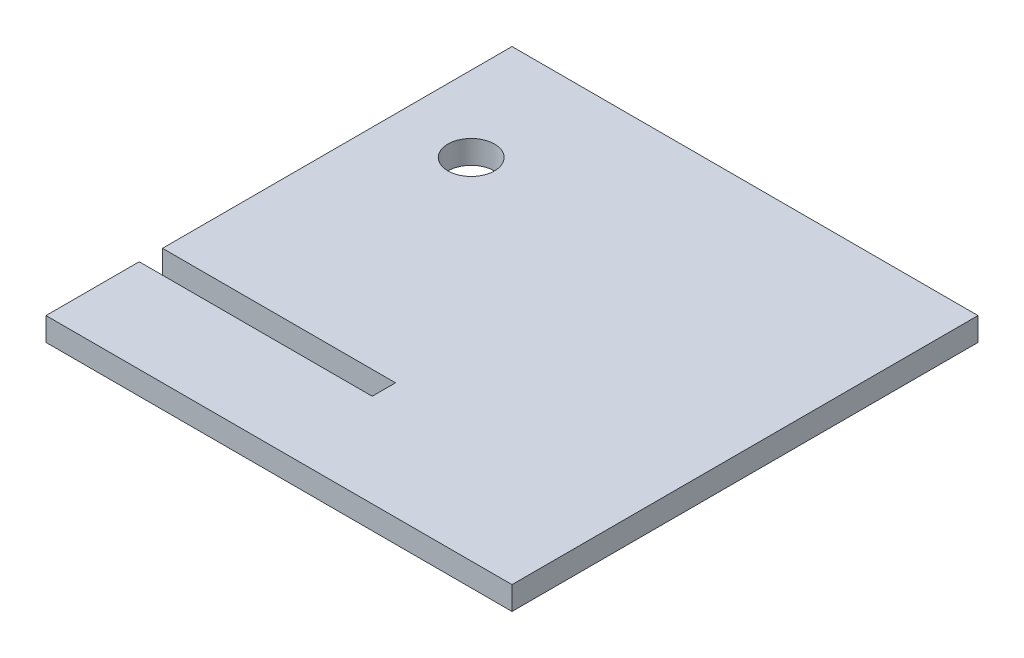
ISO-10303-21;
HEADER;
FILE_DESCRIPTION(('STEP AP214'),'2;1');
FILE_NAME('part.step','',(''),(''),'','','');
FILE_SCHEMA(('AUTOMOTIVE_DESIGN { 1 0 10303 214 1 1 1 1 }'));
ENDSEC;
DATA;
#1=APPLICATION_CONTEXT('core data for automotive mechanical design processes');
#2=APPLICATION_PROTOCOL_DEFINITION('international standard','automotive_design',2000,#1);
#3=PRODUCT_CONTEXT('',#1,'mechanical');
#4=PRODUCT('Part','Part','',(#3));
#5=PRODUCT_RELATED_PRODUCT_CATEGORY('part','',(#4));
#6=PRODUCT_DEFINITION_FORMATION('','',#4);
#7=PRODUCT_DEFINITION_CONTEXT('part definition',#1,'design');
#8=PRODUCT_DEFINITION('design','',#6,#7);
#9=PRODUCT_DEFINITION_SHAPE('','',#8);
#10=(LENGTH_UNIT() NAMED_UNIT(*) SI_UNIT(.MILLI.,.METRE.));
#11=(NAMED_UNIT(*) PLANE_ANGLE_UNIT() SI_UNIT($,.RADIAN.));
#12=(NAMED_UNIT(*) SI_UNIT($,.STERADIAN.) SOLID_ANGLE_UNIT());
#13=UNCERTAINTY_MEASURE_WITH_UNIT(LENGTH_MEASURE(1.E-05),#10,'distance_accuracy_value','');
#14=(GEOMETRIC_REPRESENTATION_CONTEXT(3) GLOBAL_UNCERTAINTY_ASSIGNED_CONTEXT((#13)) GLOBAL_UNIT_ASSIGNED_CONTEXT((#10,
#11,#12)) REPRESENTATION_CONTEXT('',''));
#15=CARTESIAN_POINT('',(0.,0.,0.));
#16=DIRECTION('',(0.,0.,1.));
#17=DIRECTION('',(1.,0.,0.));
#18=AXIS2_PLACEMENT_3D('',#15,#16,#17);
#19=CARTESIAN_POINT('',(-127.,6.35,0.));
#20=DIRECTION('',(1.,0.,0.));
#21=DIRECTION('',(0.,0.,-1.));
#22=AXIS2_PLACEMENT_3D('',#19,#20,#21);
#23=PLANE('',#22);
#24=DIRECTION('',(0.,0.,1.));
#25=VECTOR('',#24,1.);
#26=CARTESIAN_POINT('',(-127.,-6.35,0.));
#27=LINE('',#26,#25);
#28=CARTESIAN_POINT('',(-127.,-6.35,-254.));
#29=VERTEX_POINT('',#28);
#30=CARTESIAN_POINT('',(-127.,-6.35,-63.4999999999984));
#31=VERTEX_POINT('',#30);
#32=EDGE_CURVE('E124',#29,#31,#27,.T.);
#33=ORIENTED_EDGE('',*,*,#32,.T.);
#34=DIRECTION('',(0.,1.,0.));
#35=VECTOR('',#34,1.);
#36=CARTESIAN_POINT('',(-127.,-6.35,-63.4999999999984));
#37=LINE('',#36,#35);
#38=CARTESIAN_POINT('',(-127.,6.35,-63.4999999999984));
#39=VERTEX_POINT('',#38);
#40=EDGE_CURVE('E98',#31,#39,#37,.T.);
#41=ORIENTED_EDGE('',*,*,#40,.T.);
#42=DIRECTION('',(0.,0.,1.));
#43=VECTOR('',#42,1.);
#44=CARTESIAN_POINT('',(-127.,6.35,0.));
#45=LINE('',#44,#43);
#46=CARTESIAN_POINT('',(-127.,6.35,-254.));
#47=VERTEX_POINT('',#46);
#48=EDGE_CURVE('E126',#47,#39,#45,.T.);
#49=ORIENTED_EDGE('',*,*,#48,.F.);
#50=DIRECTION('',(0.,-1.,0.));
#51=VECTOR('',#50,1.);
#52=CARTESIAN_POINT('',(-127.,6.35,-254.));
#53=LINE('',#52,#51);
#54=EDGE_CURVE('E113',#47,#29,#53,.T.);
#55=ORIENTED_EDGE('',*,*,#54,.T.);
#56=EDGE_LOOP('',(#33,#41,#49,#55));
#57=FACE_BOUND('',#56,.T.);
#58=ADVANCED_FACE('F37',(#57),#23,.F.);
#59=CARTESIAN_POINT('',(-127.,6.35,-50.7999999999983));
#60=VERTEX_POINT('',#59);
#61=CARTESIAN_POINT('',(-127.,6.35,0.));
#62=VERTEX_POINT('',#61);
#63=EDGE_CURVE('E81',#60,#62,#45,.T.);
#64=ORIENTED_EDGE('',*,*,#63,.F.);
#65=DIRECTION('',(0.,1.,0.));
#66=VECTOR('',#65,1.);
#67=CARTESIAN_POINT('',(-127.,-6.35,-50.7999999999983));
#68=LINE('',#67,#66);
#69=CARTESIAN_POINT('',(-127.,-6.35,-50.7999999999983));
#70=VERTEX_POINT('',#69);
#71=EDGE_CURVE('E151',#70,#60,#68,.T.);
#72=ORIENTED_EDGE('',*,*,#71,.F.);
#73=CARTESIAN_POINT('',(-127.,-6.35,0.));
#74=VERTEX_POINT('',#73);
#75=EDGE_CURVE('E61',#70,#74,#27,.T.);
#76=ORIENTED_EDGE('',*,*,#75,.T.);
#77=DIRECTION('',(0.,-1.,0.));
#78=VECTOR('',#77,1.);
#79=CARTESIAN_POINT('',(-127.,6.35,0.));
#80=LINE('',#79,#78);
#81=EDGE_CURVE('E146',#62,#74,#80,.T.);
#82=ORIENTED_EDGE('',*,*,#81,.F.);
#83=EDGE_LOOP('',(#64,#72,#76,#82));
#84=FACE_BOUND('',#83,.T.);
#85=ADVANCED_FACE('F184',(#84),#23,.F.);
#86=CARTESIAN_POINT('',(-127.,6.35,0.));
#87=DIRECTION('',(0.,0.,-1.));
#88=DIRECTION('',(-1.,0.,0.));
#89=AXIS2_PLACEMENT_3D('',#86,#87,#88);
#90=PLANE('',#89);
#91=DIRECTION('',(1.,0.,0.));
#92=VECTOR('',#91,1.);
#93=CARTESIAN_POINT('',(-127.,-6.35,0.));
#94=LINE('',#93,#92);
#95=CARTESIAN_POINT('',(127.,-6.35,0.));
#96=VERTEX_POINT('',#95);
#97=EDGE_CURVE('E89',#74,#96,#94,.T.);
#98=ORIENTED_EDGE('',*,*,#97,.T.);
#99=DIRECTION('',(0.,-1.,0.));
#100=VECTOR('',#99,1.);
#101=CARTESIAN_POINT('',(127.,6.35,0.));
#102=LINE('',#101,#100);
#103=CARTESIAN_POINT('',(127.,6.35,0.));
#104=VERTEX_POINT('',#103);
#105=EDGE_CURVE('E120',#104,#96,#102,.T.);
#106=ORIENTED_EDGE('',*,*,#105,.F.);
#107=DIRECTION('',(1.,0.,0.));
#108=VECTOR('',#107,1.);
#109=CARTESIAN_POINT('',(-127.,6.35,0.));
#110=LINE('',#109,#108);
#111=EDGE_CURVE('E139',#62,#104,#110,.T.);
#112=ORIENTED_EDGE('',*,*,#111,.F.);
#113=ORIENTED_EDGE('',*,*,#81,.T.);
#114=EDGE_LOOP('',(#98,#106,#112,#113));
#115=FACE_BOUND('',#114,.T.);
#116=ADVANCED_FACE('F186',(#115),#90,.F.);
#117=CARTESIAN_POINT('',(127.,6.35,0.));
#118=DIRECTION('',(-1.,0.,0.));
#119=DIRECTION('',(0.,0.,1.));
#120=AXIS2_PLACEMENT_3D('',#117,#118,#119);
#121=PLANE('',#120);
#122=DIRECTION('',(0.,0.,-1.));
#123=VECTOR('',#122,1.);
#124=CARTESIAN_POINT('',(127.,-6.35,0.));
#125=LINE('',#124,#123);
#126=CARTESIAN_POINT('',(127.,-6.35,-254.));
#127=VERTEX_POINT('',#126);
#128=EDGE_CURVE('E145',#96,#127,#125,.T.);
#129=ORIENTED_EDGE('',*,*,#128,.T.);
#130=DIRECTION('',(0.,-1.,0.));
#131=VECTOR('',#130,1.);
#132=CARTESIAN_POINT('',(127.,6.35,-254.));
#133=LINE('',#132,#131);
#134=CARTESIAN_POINT('',(127.,6.35,-254.));
#135=VERTEX_POINT('',#134);
#136=EDGE_CURVE('E116',#135,#127,#133,.T.);
#137=ORIENTED_EDGE('',*,*,#136,.F.);
#138=DIRECTION('',(0.,0.,-1.));
#139=VECTOR('',#138,1.);
#140=CARTESIAN_POINT('',(127.,6.35,0.));
#141=LINE('',#140,#139);
#142=EDGE_CURVE('E137',#104,#135,#141,.T.);
#143=ORIENTED_EDGE('',*,*,#142,.F.);
#144=ORIENTED_EDGE('',*,*,#105,.T.);
#145=EDGE_LOOP('',(#129,#137,#143,#144));
#146=FACE_BOUND('',#145,.T.);
#147=ADVANCED_FACE('F192',(#146),#121,.F.);
#148=CARTESIAN_POINT('',(-127.,6.35,-254.));
#149=DIRECTION('',(0.,0.,1.));
#150=DIRECTION('',(1.,0.,0.));
#151=AXIS2_PLACEMENT_3D('',#148,#149,#150);
#152=PLANE('',#151);
#153=DIRECTION('',(-1.,0.,0.));
#154=VECTOR('',#153,1.);
#155=CARTESIAN_POINT('',(-127.,-6.35,-254.));
#156=LINE('',#155,#154);
#157=EDGE_CURVE('E109',#127,#29,#156,.T.);
#158=ORIENTED_EDGE('',*,*,#157,.T.);
#159=ORIENTED_EDGE('',*,*,#54,.F.);
#160=DIRECTION('',(-1.,0.,0.));
#161=VECTOR('',#160,1.);
#162=CARTESIAN_POINT('',(-127.,6.35,-254.));
#163=LINE('',#162,#161);
#164=EDGE_CURVE('E135',#135,#47,#163,.T.);
#165=ORIENTED_EDGE('',*,*,#164,.F.);
#166=ORIENTED_EDGE('',*,*,#136,.T.);
#167=EDGE_LOOP('',(#158,#159,#165,#166));
#168=FACE_BOUND('',#167,.T.);
#169=ADVANCED_FACE('F111',(#168),#152,.F.);
#170=CARTESIAN_POINT('',(0.,6.35,0.));
#171=DIRECTION('',(0.,-1.,0.));
#172=DIRECTION('',(0.,0.,-1.));
#173=AXIS2_PLACEMENT_3D('',#170,#171,#172);
#174=PLANE('',#173);
#175=CARTESIAN_POINT('',(-85.7499999999946,6.34999999999999,-190.5));
#176=DIRECTION('',(0.,-1.,0.));
#177=DIRECTION('',(0.,0.,-1.));
#178=AXIS2_PLACEMENT_3D('',#175,#176,#177);
#179=CIRCLE('',#178,12.7);
#180=CARTESIAN_POINT('',(-85.7499999999946,6.34999999999999,-203.2));
#181=VERTEX_POINT('',#180);
#182=EDGE_CURVE('E11',#181,#181,#179,.F.);
#183=ORIENTED_EDGE('',*,*,#182,.F.);
#184=EDGE_LOOP('',(#183));
#185=FACE_BOUND('',#184,.T.);
#186=ORIENTED_EDGE('',*,*,#48,.T.);
#187=DIRECTION('',(-1.,0.,0.));
#188=VECTOR('',#187,1.);
#189=CARTESIAN_POINT('',(-127.,6.35,-63.4999999999984));
#190=LINE('',#189,#188);
#191=CARTESIAN_POINT('',(-1.11022302462516E-13,6.35,-63.4999999999984));
#192=VERTEX_POINT('',#191);
#193=EDGE_CURVE('E165',#192,#39,#190,.T.);
#194=ORIENTED_EDGE('',*,*,#193,.F.);
#195=DIRECTION('',(0.,0.,-1.));
#196=VECTOR('',#195,1.);
#197=CARTESIAN_POINT('',(-1.11022302462516E-13,6.35,-63.4999999999984));
#198=LINE('',#197,#196);
#199=CARTESIAN_POINT('',(-1.11022302462516E-13,6.35,-50.7999999999983));
#200=VERTEX_POINT('',#199);
#201=EDGE_CURVE('E167',#200,#192,#198,.T.);
#202=ORIENTED_EDGE('',*,*,#201,.F.);
#203=DIRECTION('',(1.,0.,0.));
#204=VECTOR('',#203,1.);
#205=CARTESIAN_POINT('',(-127.,6.35,-50.7999999999983));
#206=LINE('',#205,#204);
#207=EDGE_CURVE('E170',#60,#200,#206,.T.);
#208=ORIENTED_EDGE('',*,*,#207,.F.);
#209=ORIENTED_EDGE('',*,*,#63,.T.);
#210=ORIENTED_EDGE('',*,*,#111,.T.);
#211=ORIENTED_EDGE('',*,*,#142,.T.);
#212=ORIENTED_EDGE('',*,*,#164,.T.);
#213=EDGE_LOOP('',(#186,#194,#202,#208,#209,#210,#211,#212));
#214=FACE_BOUND('',#213,.T.);
#215=ADVANCED_FACE('F39',(#185,#214),#174,.F.);
#216=CARTESIAN_POINT('',(0.,-6.35,0.));
#217=DIRECTION('',(0.,-1.,0.));
#218=DIRECTION('',(0.,0.,-1.));
#219=AXIS2_PLACEMENT_3D('',#216,#217,#218);
#220=PLANE('',#219);
#221=DIRECTION('',(-1.,0.,0.));
#222=VECTOR('',#221,1.);
#223=CARTESIAN_POINT('',(-127.,-6.35,-63.4999999999984));
#224=LINE('',#223,#222);
#225=CARTESIAN_POINT('',(-1.11022302462516E-13,-6.35,-63.4999999999984));
#226=VERTEX_POINT('',#225);
#227=EDGE_CURVE('E130',#226,#31,#224,.T.);
#228=ORIENTED_EDGE('',*,*,#227,.T.);
#229=ORIENTED_EDGE('',*,*,#32,.F.);
#230=ORIENTED_EDGE('',*,*,#157,.F.);
#231=ORIENTED_EDGE('',*,*,#128,.F.);
#232=ORIENTED_EDGE('',*,*,#97,.F.);
#233=ORIENTED_EDGE('',*,*,#75,.F.);
#234=DIRECTION('',(1.,0.,0.));
#235=VECTOR('',#234,1.);
#236=CARTESIAN_POINT('',(-127.,-6.35,-50.7999999999983));
#237=LINE('',#236,#235);
#238=CARTESIAN_POINT('',(-1.11022302462516E-13,-6.35,-50.7999999999983));
#239=VERTEX_POINT('',#238);
#240=EDGE_CURVE('E162',#70,#239,#237,.T.);
#241=ORIENTED_EDGE('',*,*,#240,.T.);
#242=DIRECTION('',(0.,0.,-1.));
#243=VECTOR('',#242,1.);
#244=CARTESIAN_POINT('',(-1.11022302462516E-13,-6.35,-63.4999999999984));
#245=LINE('',#244,#243);
#246=EDGE_CURVE('E52',#239,#226,#245,.T.);
#247=ORIENTED_EDGE('',*,*,#246,.T.);
#248=EDGE_LOOP('',(#228,#229,#230,#231,#232,#233,#241,#247));
#249=FACE_BOUND('',#248,.T.);
#250=CARTESIAN_POINT('',(-85.7499999999946,-6.34999999999999,-190.5));
#251=DIRECTION('',(0.,-1.,0.));
#252=DIRECTION('',(0.,0.,-1.));
#253=AXIS2_PLACEMENT_3D('',#250,#251,#252);
#254=CIRCLE('',#253,12.7);
#255=CARTESIAN_POINT('',(-85.7499999999946,-6.34999999999999,-203.2));
#256=VERTEX_POINT('',#255);
#257=EDGE_CURVE('E45',#256,#256,#254,.F.);
#258=ORIENTED_EDGE('',*,*,#257,.T.);
#259=EDGE_LOOP('',(#258));
#260=FACE_BOUND('',#259,.T.);
#261=ADVANCED_FACE('F128',(#249,#260),#220,.T.);
#262=CARTESIAN_POINT('',(-85.7499999999946,115.050000000001,-190.5));
#263=DIRECTION('',(0.,-1.,0.));
#264=DIRECTION('',(1.,0.,0.));
#265=AXIS2_PLACEMENT_3D('',#262,#263,#264);
#266=CYLINDRICAL_SURFACE('',#265,12.7);
#267=ORIENTED_EDGE('',*,*,#257,.F.);
#268=EDGE_LOOP('',(#267));
#269=FACE_BOUND('',#268,.T.);
#270=ORIENTED_EDGE('',*,*,#182,.T.);
#271=EDGE_LOOP('',(#270));
#272=FACE_BOUND('',#271,.T.);
#273=ADVANCED_FACE('F201',(#269,#272),#266,.F.);
#274=CARTESIAN_POINT('',(-127.,-6.35,-63.4999999999984));
#275=DIRECTION('',(0.,0.,-1.));
#276=DIRECTION('',(-1.,0.,0.));
#277=AXIS2_PLACEMENT_3D('',#274,#275,#276);
#278=PLANE('',#277);
#279=ORIENTED_EDGE('',*,*,#40,.F.);
#280=ORIENTED_EDGE('',*,*,#227,.F.);
#281=DIRECTION('',(0.,1.,0.));
#282=VECTOR('',#281,1.);
#283=CARTESIAN_POINT('',(-1.11022302462516E-13,-6.35,-63.4999999999984));
#284=LINE('',#283,#282);
#285=EDGE_CURVE('E156',#226,#192,#284,.T.);
#286=ORIENTED_EDGE('',*,*,#285,.T.);
#287=ORIENTED_EDGE('',*,*,#193,.T.);
#288=EDGE_LOOP('',(#279,#280,#286,#287));
#289=FACE_BOUND('',#288,.T.);
#290=ADVANCED_FACE('F203',(#289),#278,.F.);
#291=CARTESIAN_POINT('',(-1.11022302462516E-13,-6.35,-63.4999999999984));
#292=DIRECTION('',(1.,0.,0.));
#293=DIRECTION('',(0.,0.,-1.));
#294=AXIS2_PLACEMENT_3D('',#291,#292,#293);
#295=PLANE('',#294);
#296=ORIENTED_EDGE('',*,*,#285,.F.);
#297=ORIENTED_EDGE('',*,*,#246,.F.);
#298=DIRECTION('',(0.,1.,0.));
#299=VECTOR('',#298,1.);
#300=CARTESIAN_POINT('',(-1.11022302462516E-13,-6.35,-50.7999999999983));
#301=LINE('',#300,#299);
#302=EDGE_CURVE('E154',#239,#200,#301,.T.);
#303=ORIENTED_EDGE('',*,*,#302,.T.);
#304=ORIENTED_EDGE('',*,*,#201,.T.);
#305=EDGE_LOOP('',(#296,#297,#303,#304));
#306=FACE_BOUND('',#305,.T.);
#307=ADVANCED_FACE('F180',(#306),#295,.F.);
#308=CARTESIAN_POINT('',(-127.,-6.35,-50.7999999999983));
#309=DIRECTION('',(0.,0.,1.));
#310=DIRECTION('',(1.,0.,0.));
#311=AXIS2_PLACEMENT_3D('',#308,#309,#310);
#312=PLANE('',#311);
#313=ORIENTED_EDGE('',*,*,#302,.F.);
#314=ORIENTED_EDGE('',*,*,#240,.F.);
#315=ORIENTED_EDGE('',*,*,#71,.T.);
#316=ORIENTED_EDGE('',*,*,#207,.T.);
#317=EDGE_LOOP('',(#313,#314,#315,#316));
#318=FACE_BOUND('',#317,.T.);
#319=ADVANCED_FACE('F175',(#318),#312,.F.);
#320=CLOSED_SHELL('',(#58,#85,#116,#147,#169,#215,#261,#273,#290,#307,#319));
#321=MANIFOLD_SOLID_BREP('B2',#320);
#322=ADVANCED_BREP_SHAPE_REPRESENTATION('',(#18,#321),#14);
#323=SHAPE_DEFINITION_REPRESENTATION(#9,#322);
ENDSEC;
END-ISO-10303-21;
